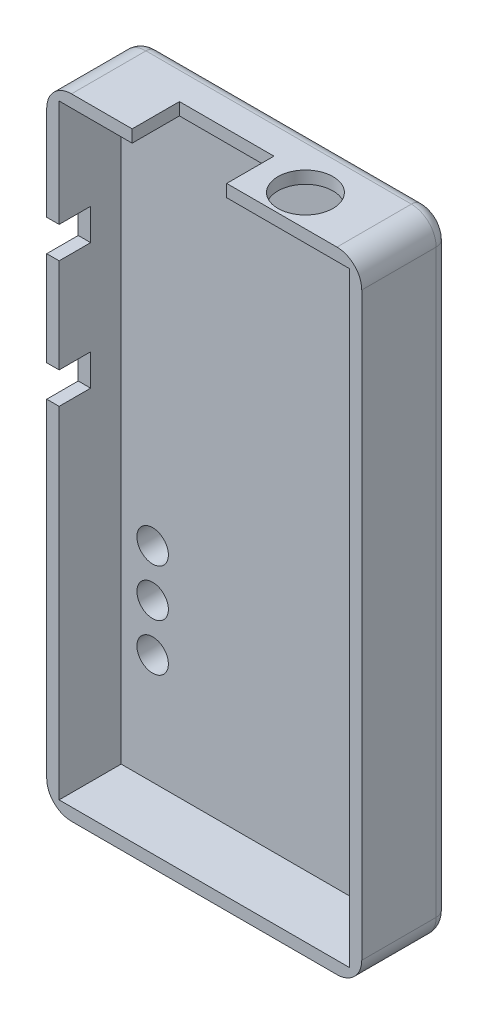
ISO-10303-21;
HEADER;
FILE_DESCRIPTION(('STEP AP214'),'2;1');
FILE_NAME('part.step','',(''),(''),'','','');
FILE_SCHEMA(('AUTOMOTIVE_DESIGN { 1 0 10303 214 1 1 1 1 }'));
ENDSEC;
DATA;
#1=APPLICATION_CONTEXT('core data for automotive mechanical design processes');
#2=APPLICATION_PROTOCOL_DEFINITION('international standard','automotive_design',2000,#1);
#3=PRODUCT_CONTEXT('',#1,'mechanical');
#4=PRODUCT('Part','Part','',(#3));
#5=PRODUCT_RELATED_PRODUCT_CATEGORY('part','',(#4));
#6=PRODUCT_DEFINITION_FORMATION('','',#4);
#7=PRODUCT_DEFINITION_CONTEXT('part definition',#1,'design');
#8=PRODUCT_DEFINITION('design','',#6,#7);
#9=PRODUCT_DEFINITION_SHAPE('','',#8);
#10=(LENGTH_UNIT() NAMED_UNIT(*) SI_UNIT(.MILLI.,.METRE.));
#11=(NAMED_UNIT(*) PLANE_ANGLE_UNIT() SI_UNIT($,.RADIAN.));
#12=(NAMED_UNIT(*) SI_UNIT($,.STERADIAN.) SOLID_ANGLE_UNIT());
#13=UNCERTAINTY_MEASURE_WITH_UNIT(LENGTH_MEASURE(1.E-05),#10,'distance_accuracy_value','');
#14=(GEOMETRIC_REPRESENTATION_CONTEXT(3) GLOBAL_UNCERTAINTY_ASSIGNED_CONTEXT((#13)) GLOBAL_UNIT_ASSIGNED_CONTEXT((#10,
#11,#12)) REPRESENTATION_CONTEXT('',''));
#15=CARTESIAN_POINT('',(0.,0.,0.));
#16=DIRECTION('',(0.,0.,1.));
#17=DIRECTION('',(1.,0.,0.));
#18=AXIS2_PLACEMENT_3D('',#15,#16,#17);
#19=CARTESIAN_POINT('',(0.,0.,7.000000986));
#20=DIRECTION('',(0.,0.,1.));
#21=DIRECTION('',(1.,0.,0.));
#22=AXIS2_PLACEMENT_3D('',#19,#20,#21);
#23=PLANE('',#22);
#24=DIRECTION('',(-1.,0.,0.));
#25=VECTOR('',#24,1.);
#26=CARTESIAN_POINT('',(25.401,31.019999936,7.000000986));
#27=LINE('',#26,#25);
#28=CARTESIAN_POINT('',(1.00000054,31.019999936,7.000000986));
#29=VERTEX_POINT('',#28);
#30=CARTESIAN_POINT('',(0.,31.019999936,7.000000986));
#31=VERTEX_POINT('',#30);
#32=EDGE_CURVE('E225',#29,#31,#27,.T.);
#33=ORIENTED_EDGE('',*,*,#32,.F.);
#34=DIRECTION('',(0.,-1.,0.));
#35=VECTOR('',#34,1.);
#36=CARTESIAN_POINT('',(1.00000054,49.79999946,7.000000986));
#37=LINE('',#36,#35);
#38=CARTESIAN_POINT('',(1.00000054,38.639999936,7.000000986));
#39=VERTEX_POINT('',#38);
#40=EDGE_CURVE('E236',#39,#29,#37,.T.);
#41=ORIENTED_EDGE('',*,*,#40,.F.);
#42=DIRECTION('',(-1.,0.,0.));
#43=VECTOR('',#42,1.);
#44=CARTESIAN_POINT('',(25.401,38.639999936,7.000000986));
#45=LINE('',#44,#43);
#46=CARTESIAN_POINT('',(0.,38.639999936,7.000000986));
#47=VERTEX_POINT('',#46);
#48=EDGE_CURVE('E60',#39,#47,#45,.T.);
#49=ORIENTED_EDGE('',*,*,#48,.T.);
#50=DIRECTION('',(0.,-1.,0.));
#51=VECTOR('',#50,1.);
#52=CARTESIAN_POINT('',(0.,50.8,7.000000986));
#53=LINE('',#52,#51);
#54=EDGE_CURVE('E238',#47,#31,#53,.T.);
#55=ORIENTED_EDGE('',*,*,#54,.T.);
#56=EDGE_LOOP('',(#33,#41,#49,#55));
#57=FACE_BOUND('',#56,.T.);
#58=ADVANCED_FACE('F35',(#57),#23,.T.);
#59=DIRECTION('',(-1.,0.,0.));
#60=VECTOR('',#59,1.);
#61=CARTESIAN_POINT('',(25.401,41.179999936,7.000000986));
#62=LINE('',#61,#60);
#63=CARTESIAN_POINT('',(1.00000054,41.179999936,7.000000986));
#64=VERTEX_POINT('',#63);
#65=CARTESIAN_POINT('',(0.,41.179999936,7.000000986));
#66=VERTEX_POINT('',#65);
#67=EDGE_CURVE('E401',#64,#66,#62,.T.);
#68=ORIENTED_EDGE('',*,*,#67,.F.);
#69=CARTESIAN_POINT('',(1.00000054,49.79999946,7.000000986));
#70=VERTEX_POINT('',#69);
#71=EDGE_CURVE('E244',#70,#64,#37,.T.);
#72=ORIENTED_EDGE('',*,*,#71,.F.);
#73=DIRECTION('',(-1.,0.,0.));
#74=VECTOR('',#73,1.);
#75=CARTESIAN_POINT('',(24.39999946,49.79999946,7.000000986));
#76=LINE('',#75,#74);
#77=CARTESIAN_POINT('',(6.88999993600001,49.79999946,7.000000986));
#78=VERTEX_POINT('',#77);
#79=EDGE_CURVE('E473',#78,#70,#76,.T.);
#80=ORIENTED_EDGE('',*,*,#79,.F.);
#81=DIRECTION('',(0.,1.,0.));
#82=VECTOR('',#81,1.);
#83=CARTESIAN_POINT('',(6.889999936,-0.001000000000001,7.000000986));
#84=LINE('',#83,#82);
#85=CARTESIAN_POINT('',(6.889999936,50.8,7.000000986));
#86=VERTEX_POINT('',#85);
#87=EDGE_CURVE('E405',#78,#86,#84,.T.);
#88=ORIENTED_EDGE('',*,*,#87,.T.);
#89=DIRECTION('',(-1.,0.,0.));
#90=VECTOR('',#89,1.);
#91=CARTESIAN_POINT('',(25.4,50.8,7.000000986));
#92=LINE('',#91,#90);
#93=CARTESIAN_POINT('',(2.000000064,50.8,7.000000986));
#94=VERTEX_POINT('',#93);
#95=EDGE_CURVE('E279',#86,#94,#92,.T.);
#96=ORIENTED_EDGE('',*,*,#95,.T.);
#97=CARTESIAN_POINT('',(2.000000064,48.799999936,7.000000986));
#98=DIRECTION('',(0.,0.,1.));
#99=DIRECTION('',(1.,0.,0.));
#100=AXIS2_PLACEMENT_3D('',#97,#98,#99);
#101=CIRCLE('',#100,2.000000064);
#102=CARTESIAN_POINT('',(0.,48.799999936,7.000000986));
#103=VERTEX_POINT('',#102);
#104=EDGE_CURVE('E303',#94,#103,#101,.T.);
#105=ORIENTED_EDGE('',*,*,#104,.T.);
#106=EDGE_CURVE('E284',#103,#66,#53,.T.);
#107=ORIENTED_EDGE('',*,*,#106,.T.);
#108=EDGE_LOOP('',(#68,#72,#80,#88,#96,#105,#107));
#109=FACE_BOUND('',#108,.T.);
#110=ADVANCED_FACE('F399',(#109),#23,.T.);
#111=CARTESIAN_POINT('',(0.,0.,2.00000108));
#112=DIRECTION('',(1.,0.,0.));
#113=DIRECTION('',(0.,1.,0.));
#114=AXIS2_PLACEMENT_3D('',#111,#112,#113);
#115=PLANE('',#114);
#116=DIRECTION('',(0.,-1.,0.));
#117=VECTOR('',#116,1.);
#118=CARTESIAN_POINT('',(0.,31.019999936,4.460000986));
#119=LINE('',#118,#117);
#120=CARTESIAN_POINT('',(0.,31.019999936,4.460000986));
#121=VERTEX_POINT('',#120);
#122=CARTESIAN_POINT('',(0.,28.479999936,4.460000986));
#123=VERTEX_POINT('',#122);
#124=EDGE_CURVE('E520',#121,#123,#119,.T.);
#125=ORIENTED_EDGE('',*,*,#124,.F.);
#126=DIRECTION('',(0.,0.,-1.));
#127=VECTOR('',#126,1.);
#128=CARTESIAN_POINT('',(0.,31.019999936,7.000000986));
#129=LINE('',#128,#127);
#130=EDGE_CURVE('E523',#31,#121,#129,.T.);
#131=ORIENTED_EDGE('',*,*,#130,.F.);
#132=ORIENTED_EDGE('',*,*,#54,.F.);
#133=DIRECTION('',(0.,0.,1.));
#134=VECTOR('',#133,1.);
#135=CARTESIAN_POINT('',(0.,38.639999936,7.000000986));
#136=LINE('',#135,#134);
#137=CARTESIAN_POINT('',(0.,38.639999936,4.460000986));
#138=VERTEX_POINT('',#137);
#139=EDGE_CURVE('E503',#138,#47,#136,.T.);
#140=ORIENTED_EDGE('',*,*,#139,.F.);
#141=DIRECTION('',(0.,-1.,0.));
#142=VECTOR('',#141,1.);
#143=CARTESIAN_POINT('',(0.,41.179999936,4.460000986));
#144=LINE('',#143,#142);
#145=CARTESIAN_POINT('',(0.,41.179999936,4.460000986));
#146=VERTEX_POINT('',#145);
#147=EDGE_CURVE('E509',#146,#138,#144,.T.);
#148=ORIENTED_EDGE('',*,*,#147,.F.);
#149=DIRECTION('',(0.,0.,-1.));
#150=VECTOR('',#149,1.);
#151=CARTESIAN_POINT('',(0.,41.179999936,7.000000986));
#152=LINE('',#151,#150);
#153=EDGE_CURVE('E396',#66,#146,#152,.T.);
#154=ORIENTED_EDGE('',*,*,#153,.F.);
#155=ORIENTED_EDGE('',*,*,#106,.F.);
#156=DIRECTION('',(0.,0.,-1.));
#157=VECTOR('',#156,1.);
#158=CARTESIAN_POINT('',(0.,48.799999936,2.00000108));
#159=LINE('',#158,#157);
#160=CARTESIAN_POINT('',(0.,48.799999936,1.000000032));
#161=VERTEX_POINT('',#160);
#162=EDGE_CURVE('E295',#103,#161,#159,.T.);
#163=ORIENTED_EDGE('',*,*,#162,.T.);
#164=DIRECTION('',(0.,-1.,0.));
#165=VECTOR('',#164,1.);
#166=CARTESIAN_POINT('',(0.,2.000000064,1.000000032));
#167=LINE('',#166,#165);
#168=CARTESIAN_POINT('',(0.,2.000000064,1.000000032));
#169=VERTEX_POINT('',#168);
#170=EDGE_CURVE('E344',#161,#169,#167,.T.);
#171=ORIENTED_EDGE('',*,*,#170,.T.);
#172=DIRECTION('',(0.,0.,-1.));
#173=VECTOR('',#172,1.);
#174=CARTESIAN_POINT('',(0.,2.000000064,2.00000108));
#175=LINE('',#174,#173);
#176=CARTESIAN_POINT('',(0.,2.000000064,7.000000986));
#177=VERTEX_POINT('',#176);
#178=EDGE_CURVE('E298',#169,#177,#175,.F.);
#179=ORIENTED_EDGE('',*,*,#178,.T.);
#180=CARTESIAN_POINT('',(0.,28.479999936,7.000000986));
#181=VERTEX_POINT('',#180);
#182=EDGE_CURVE('E283',#181,#177,#53,.T.);
#183=ORIENTED_EDGE('',*,*,#182,.F.);
#184=DIRECTION('',(0.,0.,1.));
#185=VECTOR('',#184,1.);
#186=CARTESIAN_POINT('',(0.,28.479999936,7.000000986));
#187=LINE('',#186,#185);
#188=EDGE_CURVE('E239',#123,#181,#187,.T.);
#189=ORIENTED_EDGE('',*,*,#188,.F.);
#190=EDGE_LOOP('',(#125,#131,#132,#140,#148,#154,#155,#163,#171,#179,#183,#189));
#191=FACE_BOUND('',#190,.T.);
#192=ADVANCED_FACE('F391',(#191),#115,.F.);
#193=CARTESIAN_POINT('',(0.,0.,2.00000108));
#194=DIRECTION('',(0.,1.,0.));
#195=DIRECTION('',(0.,0.,1.));
#196=AXIS2_PLACEMENT_3D('',#193,#194,#195);
#197=PLANE('',#196);
#198=DIRECTION('',(0.,0.,-1.));
#199=VECTOR('',#198,1.);
#200=CARTESIAN_POINT('',(2.000000064,0.,2.00000108));
#201=LINE('',#200,#199);
#202=CARTESIAN_POINT('',(2.000000064,0.,7.000000986));
#203=VERTEX_POINT('',#202);
#204=CARTESIAN_POINT('',(2.000000064,0.,1.000000032));
#205=VERTEX_POINT('',#204);
#206=EDGE_CURVE('E292',#203,#205,#201,.T.);
#207=ORIENTED_EDGE('',*,*,#206,.T.);
#208=DIRECTION('',(1.,0.,0.));
#209=VECTOR('',#208,1.);
#210=CARTESIAN_POINT('',(23.399999936,0.,1.000000032));
#211=LINE('',#210,#209);
#212=CARTESIAN_POINT('',(23.399999936,0.,1.000000032));
#213=VERTEX_POINT('',#212);
#214=EDGE_CURVE('E340',#205,#213,#211,.T.);
#215=ORIENTED_EDGE('',*,*,#214,.T.);
#216=DIRECTION('',(0.,0.,-1.));
#217=VECTOR('',#216,1.);
#218=CARTESIAN_POINT('',(23.399999936,0.,2.00000108));
#219=LINE('',#218,#217);
#220=CARTESIAN_POINT('',(23.399999936,0.,7.000000986));
#221=VERTEX_POINT('',#220);
#222=EDGE_CURVE('E290',#213,#221,#219,.F.);
#223=ORIENTED_EDGE('',*,*,#222,.T.);
#224=DIRECTION('',(1.,0.,0.));
#225=VECTOR('',#224,1.);
#226=CARTESIAN_POINT('',(0.,0.,7.000000986));
#227=LINE('',#226,#225);
#228=EDGE_CURVE('E287',#203,#221,#227,.T.);
#229=ORIENTED_EDGE('',*,*,#228,.F.);
#230=EDGE_LOOP('',(#207,#215,#223,#229));
#231=FACE_BOUND('',#230,.T.);
#232=ADVANCED_FACE('F443',(#231),#197,.F.);
#233=CARTESIAN_POINT('',(25.4,0.,2.00000108));
#234=DIRECTION('',(-1.,0.,0.));
#235=DIRECTION('',(0.,-1.,0.));
#236=AXIS2_PLACEMENT_3D('',#233,#234,#235);
#237=PLANE('',#236);
#238=DIRECTION('',(0.,0.,-1.));
#239=VECTOR('',#238,1.);
#240=CARTESIAN_POINT('',(25.4,2.000000064,2.00000108));
#241=LINE('',#240,#239);
#242=CARTESIAN_POINT('',(25.4,2.000000064,7.000000986));
#243=VERTEX_POINT('',#242);
#244=CARTESIAN_POINT('',(25.4,2.000000064,1.000000032));
#245=VERTEX_POINT('',#244);
#246=EDGE_CURVE('E311',#243,#245,#241,.T.);
#247=ORIENTED_EDGE('',*,*,#246,.T.);
#248=DIRECTION('',(0.,1.,0.));
#249=VECTOR('',#248,1.);
#250=CARTESIAN_POINT('',(25.4,48.799999936,1.000000032));
#251=LINE('',#250,#249);
#252=CARTESIAN_POINT('',(25.4,48.799999936,1.000000032));
#253=VERTEX_POINT('',#252);
#254=EDGE_CURVE('E11',#245,#253,#251,.T.);
#255=ORIENTED_EDGE('',*,*,#254,.T.);
#256=DIRECTION('',(0.,0.,-1.));
#257=VECTOR('',#256,1.);
#258=CARTESIAN_POINT('',(25.4,48.799999936,2.00000108));
#259=LINE('',#258,#257);
#260=CARTESIAN_POINT('',(25.4,48.799999936,7.000000986));
#261=VERTEX_POINT('',#260);
#262=EDGE_CURVE('E309',#253,#261,#259,.F.);
#263=ORIENTED_EDGE('',*,*,#262,.T.);
#264=DIRECTION('',(0.,1.,0.));
#265=VECTOR('',#264,1.);
#266=CARTESIAN_POINT('',(25.4,0.,7.000000986));
#267=LINE('',#266,#265);
#268=EDGE_CURVE('E276',#243,#261,#267,.T.);
#269=ORIENTED_EDGE('',*,*,#268,.F.);
#270=EDGE_LOOP('',(#247,#255,#263,#269));
#271=FACE_BOUND('',#270,.T.);
#272=ADVANCED_FACE('F454',(#271),#237,.F.);
#273=CARTESIAN_POINT('',(0.,50.8,2.00000108));
#274=DIRECTION('',(0.,-1.,0.));
#275=DIRECTION('',(0.,0.,-1.));
#276=AXIS2_PLACEMENT_3D('',#273,#274,#275);
#277=PLANE('',#276);
#278=CARTESIAN_POINT('',(18.319999936,50.8,4.460000986));
#279=DIRECTION('',(0.,1.,0.));
#280=DIRECTION('',(0.,0.,1.));
#281=AXIS2_PLACEMENT_3D('',#278,#279,#280);
#282=CIRCLE('',#281,2.2225);
#283=CARTESIAN_POINT('',(18.319999936,50.8,6.682500986));
#284=VERTEX_POINT('',#283);
#285=EDGE_CURVE('E354',#284,#284,#282,.T.);
#286=ORIENTED_EDGE('',*,*,#285,.F.);
#287=EDGE_LOOP('',(#286));
#288=FACE_BOUND('',#287,.T.);
#289=ORIENTED_EDGE('',*,*,#95,.F.);
#290=DIRECTION('',(0.,0.,1.));
#291=VECTOR('',#290,1.);
#292=CARTESIAN_POINT('',(6.889999936,50.8,7.000000986));
#293=LINE('',#292,#291);
#294=CARTESIAN_POINT('',(6.889999936,50.8,3.190000986));
#295=VERTEX_POINT('',#294);
#296=EDGE_CURVE('E462',#295,#86,#293,.T.);
#297=ORIENTED_EDGE('',*,*,#296,.F.);
#298=DIRECTION('',(-1.,0.,0.));
#299=VECTOR('',#298,1.);
#300=CARTESIAN_POINT('',(6.889999936,50.8,3.190000986));
#301=LINE('',#300,#299);
#302=CARTESIAN_POINT('',(14.509999936,50.8,3.190000986));
#303=VERTEX_POINT('',#302);
#304=EDGE_CURVE('E483',#303,#295,#301,.T.);
#305=ORIENTED_EDGE('',*,*,#304,.F.);
#306=DIRECTION('',(0.,0.,-1.));
#307=VECTOR('',#306,1.);
#308=CARTESIAN_POINT('',(14.509999936,50.8,7.000000986));
#309=LINE('',#308,#307);
#310=CARTESIAN_POINT('',(14.509999936,50.8,7.000000986));
#311=VERTEX_POINT('',#310);
#312=EDGE_CURVE('E495',#311,#303,#309,.T.);
#313=ORIENTED_EDGE('',*,*,#312,.F.);
#314=CARTESIAN_POINT('',(23.399999936,50.8,7.000000986));
#315=VERTEX_POINT('',#314);
#316=EDGE_CURVE('E280',#315,#311,#92,.T.);
#317=ORIENTED_EDGE('',*,*,#316,.F.);
#318=DIRECTION('',(0.,0.,-1.));
#319=VECTOR('',#318,1.);
#320=CARTESIAN_POINT('',(23.399999936,50.8,2.00000108));
#321=LINE('',#320,#319);
#322=CARTESIAN_POINT('',(23.399999936,50.8,1.000000032));
#323=VERTEX_POINT('',#322);
#324=EDGE_CURVE('E314',#315,#323,#321,.T.);
#325=ORIENTED_EDGE('',*,*,#324,.T.);
#326=DIRECTION('',(-1.,0.,0.));
#327=VECTOR('',#326,1.);
#328=CARTESIAN_POINT('',(2.000000064,50.8,1.000000032));
#329=LINE('',#328,#327);
#330=CARTESIAN_POINT('',(2.000000064,50.8,1.000000032));
#331=VERTEX_POINT('',#330);
#332=EDGE_CURVE('E348',#323,#331,#329,.T.);
#333=ORIENTED_EDGE('',*,*,#332,.T.);
#334=DIRECTION('',(0.,0.,-1.));
#335=VECTOR('',#334,1.);
#336=CARTESIAN_POINT('',(2.000000064,50.8,2.00000108));
#337=LINE('',#336,#335);
#338=EDGE_CURVE('E317',#331,#94,#337,.F.);
#339=ORIENTED_EDGE('',*,*,#338,.T.);
#340=EDGE_LOOP('',(#289,#297,#305,#313,#317,#325,#333,#339));
#341=FACE_BOUND('',#340,.T.);
#342=ADVANCED_FACE('F408',(#288,#341),#277,.F.);
#343=CARTESIAN_POINT('',(0.,0.,0.));
#344=DIRECTION('',(0.,0.,-1.));
#345=DIRECTION('',(-1.,0.,0.));
#346=AXIS2_PLACEMENT_3D('',#343,#344,#345);
#347=PLANE('',#346);
#348=CARTESIAN_POINT('',(3.540000032,17.510000032,0.));
#349=DIRECTION('',(0.,0.,-1.));
#350=DIRECTION('',(-1.,0.,0.));
#351=AXIS2_PLACEMENT_3D('',#348,#349,#350);
#352=CIRCLE('',#351,1.27);
#353=CARTESIAN_POINT('',(2.270000032,17.510000032,0.));
#354=VERTEX_POINT('',#353);
#355=EDGE_CURVE('E544',#354,#354,#352,.T.);
#356=ORIENTED_EDGE('',*,*,#355,.F.);
#357=EDGE_LOOP('',(#356));
#358=FACE_BOUND('',#357,.T.);
#359=CARTESIAN_POINT('',(3.540000032,13.700000032,0.));
#360=DIRECTION('',(0.,0.,-1.));
#361=DIRECTION('',(-1.,0.,0.));
#362=AXIS2_PLACEMENT_3D('',#359,#360,#361);
#363=CIRCLE('',#362,1.27);
#364=CARTESIAN_POINT('',(2.270000032,13.700000032,0.));
#365=VERTEX_POINT('',#364);
#366=EDGE_CURVE('E538',#365,#365,#363,.T.);
#367=ORIENTED_EDGE('',*,*,#366,.F.);
#368=EDGE_LOOP('',(#367));
#369=FACE_BOUND('',#368,.T.);
#370=CARTESIAN_POINT('',(3.540000032,9.890000032,0.));
#371=DIRECTION('',(0.,0.,-1.));
#372=DIRECTION('',(-1.,0.,0.));
#373=AXIS2_PLACEMENT_3D('',#370,#371,#372);
#374=CIRCLE('',#373,1.27);
#375=CARTESIAN_POINT('',(2.270000032,9.890000032,0.));
#376=VERTEX_POINT('',#375);
#377=EDGE_CURVE('E532',#376,#376,#374,.T.);
#378=ORIENTED_EDGE('',*,*,#377,.F.);
#379=EDGE_LOOP('',(#378));
#380=FACE_BOUND('',#379,.T.);
#381=DIRECTION('',(0.,1.,0.));
#382=VECTOR('',#381,1.);
#383=CARTESIAN_POINT('',(24.399999968,2.000000064,0.));
#384=LINE('',#383,#382);
#385=CARTESIAN_POINT('',(24.399999968,48.799999936,0.));
#386=VERTEX_POINT('',#385);
#387=CARTESIAN_POINT('',(24.399999968,2.000000064,0.));
#388=VERTEX_POINT('',#387);
#389=EDGE_CURVE('E320',#386,#388,#384,.F.);
#390=ORIENTED_EDGE('',*,*,#389,.T.);
#391=CARTESIAN_POINT('',(23.399999936,2.000000064,0.));
#392=DIRECTION('',(0.,0.,-1.));
#393=DIRECTION('',(-1.,0.,0.));
#394=AXIS2_PLACEMENT_3D('',#391,#392,#393);
#395=CIRCLE('',#394,1.000000032);
#396=CARTESIAN_POINT('',(23.399999936,1.000000032,0.));
#397=VERTEX_POINT('',#396);
#398=EDGE_CURVE('E334',#388,#397,#395,.T.);
#399=ORIENTED_EDGE('',*,*,#398,.T.);
#400=DIRECTION('',(1.,0.,0.));
#401=VECTOR('',#400,1.);
#402=CARTESIAN_POINT('',(2.000000064,1.000000032,0.));
#403=LINE('',#402,#401);
#404=CARTESIAN_POINT('',(2.000000064,1.000000032,0.));
#405=VERTEX_POINT('',#404);
#406=EDGE_CURVE('E332',#397,#405,#403,.F.);
#407=ORIENTED_EDGE('',*,*,#406,.T.);
#408=CARTESIAN_POINT('',(2.000000064,2.000000064,0.));
#409=DIRECTION('',(0.,0.,-1.));
#410=DIRECTION('',(-1.,0.,0.));
#411=AXIS2_PLACEMENT_3D('',#408,#409,#410);
#412=CIRCLE('',#411,1.000000032);
#413=CARTESIAN_POINT('',(1.000000032,2.000000064,0.));
#414=VERTEX_POINT('',#413);
#415=EDGE_CURVE('E330',#405,#414,#412,.T.);
#416=ORIENTED_EDGE('',*,*,#415,.T.);
#417=DIRECTION('',(0.,-1.,0.));
#418=VECTOR('',#417,1.);
#419=CARTESIAN_POINT('',(1.000000032,48.799999936,0.));
#420=LINE('',#419,#418);
#421=CARTESIAN_POINT('',(1.000000032,48.799999936,0.));
#422=VERTEX_POINT('',#421);
#423=EDGE_CURVE('E328',#414,#422,#420,.F.);
#424=ORIENTED_EDGE('',*,*,#423,.T.);
#425=CARTESIAN_POINT('',(2.000000064,48.799999936,0.));
#426=DIRECTION('',(0.,0.,-1.));
#427=DIRECTION('',(-1.,0.,0.));
#428=AXIS2_PLACEMENT_3D('',#425,#426,#427);
#429=CIRCLE('',#428,1.000000032);
#430=CARTESIAN_POINT('',(2.000000064,49.799999968,0.));
#431=VERTEX_POINT('',#430);
#432=EDGE_CURVE('E326',#422,#431,#429,.T.);
#433=ORIENTED_EDGE('',*,*,#432,.T.);
#434=DIRECTION('',(-1.,0.,0.));
#435=VECTOR('',#434,1.);
#436=CARTESIAN_POINT('',(23.399999936,49.799999968,0.));
#437=LINE('',#436,#435);
#438=CARTESIAN_POINT('',(23.399999936,49.799999968,0.));
#439=VERTEX_POINT('',#438);
#440=EDGE_CURVE('E324',#431,#439,#437,.F.);
#441=ORIENTED_EDGE('',*,*,#440,.T.);
#442=CARTESIAN_POINT('',(23.399999936,48.799999936,0.));
#443=DIRECTION('',(0.,0.,-1.));
#444=DIRECTION('',(-1.,0.,0.));
#445=AXIS2_PLACEMENT_3D('',#442,#443,#444);
#446=CIRCLE('',#445,1.000000032);
#447=EDGE_CURVE('E322',#439,#386,#446,.T.);
#448=ORIENTED_EDGE('',*,*,#447,.T.);
#449=EDGE_LOOP('',(#390,#399,#407,#416,#424,#433,#441,#448));
#450=FACE_BOUND('',#449,.T.);
#451=ADVANCED_FACE('F428',(#358,#369,#380,#450),#347,.T.);
#452=DIRECTION('',(-1.,0.,0.));
#453=VECTOR('',#452,1.);
#454=CARTESIAN_POINT('',(25.401,28.479999936,7.000000986));
#455=LINE('',#454,#453);
#456=CARTESIAN_POINT('',(1.00000054,28.479999936,7.000000986));
#457=VERTEX_POINT('',#456);
#458=EDGE_CURVE('E52',#457,#181,#455,.T.);
#459=ORIENTED_EDGE('',*,*,#458,.T.);
#460=ORIENTED_EDGE('',*,*,#182,.T.);
#461=CARTESIAN_POINT('',(2.000000064,2.000000064,7.000000986));
#462=DIRECTION('',(0.,0.,1.));
#463=DIRECTION('',(1.,0.,0.));
#464=AXIS2_PLACEMENT_3D('',#461,#462,#463);
#465=CIRCLE('',#464,2.000000064);
#466=EDGE_CURVE('E307',#177,#203,#465,.T.);
#467=ORIENTED_EDGE('',*,*,#466,.T.);
#468=ORIENTED_EDGE('',*,*,#228,.T.);
#469=CARTESIAN_POINT('',(23.399999936,2.000000064,7.000000986));
#470=DIRECTION('',(0.,0.,1.));
#471=DIRECTION('',(1.,0.,0.));
#472=AXIS2_PLACEMENT_3D('',#469,#470,#471);
#473=CIRCLE('',#472,2.000000064);
#474=EDGE_CURVE('E305',#221,#243,#473,.T.);
#475=ORIENTED_EDGE('',*,*,#474,.T.);
#476=ORIENTED_EDGE('',*,*,#268,.T.);
#477=CARTESIAN_POINT('',(23.399999936,48.799999936,7.000000986));
#478=DIRECTION('',(0.,0.,1.));
#479=DIRECTION('',(1.,0.,0.));
#480=AXIS2_PLACEMENT_3D('',#477,#478,#479);
#481=CIRCLE('',#480,2.000000064);
#482=EDGE_CURVE('E301',#261,#315,#481,.T.);
#483=ORIENTED_EDGE('',*,*,#482,.T.);
#484=ORIENTED_EDGE('',*,*,#316,.T.);
#485=DIRECTION('',(0.,1.,0.));
#486=VECTOR('',#485,1.);
#487=CARTESIAN_POINT('',(14.509999936,-0.001000000000001,7.000000986));
#488=LINE('',#487,#486);
#489=CARTESIAN_POINT('',(14.509999936,49.79999946,7.000000986));
#490=VERTEX_POINT('',#489);
#491=EDGE_CURVE('E457',#490,#311,#488,.T.);
#492=ORIENTED_EDGE('',*,*,#491,.F.);
#493=CARTESIAN_POINT('',(24.39999946,49.79999946,7.000000986));
#494=VERTEX_POINT('',#493);
#495=EDGE_CURVE('E249',#494,#490,#76,.T.);
#496=ORIENTED_EDGE('',*,*,#495,.F.);
#497=DIRECTION('',(0.,1.,0.));
#498=VECTOR('',#497,1.);
#499=CARTESIAN_POINT('',(24.39999946,49.79999946,7.000000986));
#500=LINE('',#499,#498);
#501=CARTESIAN_POINT('',(24.39999946,1.00000054,7.000000986));
#502=VERTEX_POINT('',#501);
#503=EDGE_CURVE('E267',#502,#494,#500,.T.);
#504=ORIENTED_EDGE('',*,*,#503,.F.);
#505=DIRECTION('',(1.,0.,0.));
#506=VECTOR('',#505,1.);
#507=CARTESIAN_POINT('',(24.39999946,1.00000054,7.000000986));
#508=LINE('',#507,#506);
#509=CARTESIAN_POINT('',(1.00000054000001,1.00000054,7.000000986));
#510=VERTEX_POINT('',#509);
#511=EDGE_CURVE('E248',#510,#502,#508,.T.);
#512=ORIENTED_EDGE('',*,*,#511,.F.);
#513=EDGE_CURVE('E245',#457,#510,#37,.T.);
#514=ORIENTED_EDGE('',*,*,#513,.F.);
#515=EDGE_LOOP('',(#459,#460,#467,#468,#475,#476,#483,#484,#492,#496,#504,#512,#514));
#516=FACE_BOUND('',#515,.T.);
#517=ADVANCED_FACE('F447',(#516),#23,.T.);
#518=CARTESIAN_POINT('',(24.39999946,49.79999946,7.000000986));
#519=DIRECTION('',(-1.,0.,0.));
#520=DIRECTION('',(0.,-1.,0.));
#521=AXIS2_PLACEMENT_3D('',#518,#519,#520);
#522=PLANE('',#521);
#523=DIRECTION('',(0.,1.,0.));
#524=VECTOR('',#523,1.);
#525=CARTESIAN_POINT('',(24.39999946,49.79999946,2.00000108));
#526=LINE('',#525,#524);
#527=CARTESIAN_POINT('',(24.39999946,1.00000054,2.00000108));
#528=VERTEX_POINT('',#527);
#529=CARTESIAN_POINT('',(24.39999946,49.79999946,2.00000108));
#530=VERTEX_POINT('',#529);
#531=EDGE_CURVE('E255',#528,#530,#526,.T.);
#532=ORIENTED_EDGE('',*,*,#531,.F.);
#533=DIRECTION('',(0.,0.,-1.));
#534=VECTOR('',#533,1.);
#535=CARTESIAN_POINT('',(24.39999946,1.00000054,7.000000986));
#536=LINE('',#535,#534);
#537=EDGE_CURVE('E254',#502,#528,#536,.T.);
#538=ORIENTED_EDGE('',*,*,#537,.F.);
#539=ORIENTED_EDGE('',*,*,#503,.T.);
#540=DIRECTION('',(0.,0.,-1.));
#541=VECTOR('',#540,1.);
#542=CARTESIAN_POINT('',(24.39999946,49.79999946,7.000000986));
#543=LINE('',#542,#541);
#544=EDGE_CURVE('E273',#494,#530,#543,.T.);
#545=ORIENTED_EDGE('',*,*,#544,.T.);
#546=EDGE_LOOP('',(#532,#538,#539,#545));
#547=FACE_BOUND('',#546,.T.);
#548=ADVANCED_FACE('F578',(#547),#522,.T.);
#549=CARTESIAN_POINT('',(24.39999946,49.79999946,7.000000986));
#550=DIRECTION('',(0.,-1.,0.));
#551=DIRECTION('',(0.,0.,-1.));
#552=AXIS2_PLACEMENT_3D('',#549,#550,#551);
#553=PLANE('',#552);
#554=DIRECTION('',(0.,0.,1.));
#555=VECTOR('',#554,1.);
#556=CARTESIAN_POINT('',(6.889999936,49.79999946,7.000000986));
#557=LINE('',#556,#555);
#558=CARTESIAN_POINT('',(6.889999936,49.79999946,3.190000986));
#559=VERTEX_POINT('',#558);
#560=EDGE_CURVE('E485',#559,#78,#557,.T.);
#561=ORIENTED_EDGE('',*,*,#560,.T.);
#562=ORIENTED_EDGE('',*,*,#79,.T.);
#563=DIRECTION('',(0.,0.,-1.));
#564=VECTOR('',#563,1.);
#565=CARTESIAN_POINT('',(1.00000054,49.79999946,7.000000986));
#566=LINE('',#565,#564);
#567=CARTESIAN_POINT('',(1.00000054,49.79999946,2.00000108));
#568=VERTEX_POINT('',#567);
#569=EDGE_CURVE('E271',#70,#568,#566,.T.);
#570=ORIENTED_EDGE('',*,*,#569,.T.);
#571=DIRECTION('',(-1.,0.,0.));
#572=VECTOR('',#571,1.);
#573=CARTESIAN_POINT('',(24.39999946,49.79999946,2.00000108));
#574=LINE('',#573,#572);
#575=EDGE_CURVE('E258',#530,#568,#574,.T.);
#576=ORIENTED_EDGE('',*,*,#575,.F.);
#577=ORIENTED_EDGE('',*,*,#544,.F.);
#578=ORIENTED_EDGE('',*,*,#495,.T.);
#579=DIRECTION('',(0.,0.,-1.));
#580=VECTOR('',#579,1.);
#581=CARTESIAN_POINT('',(14.509999936,49.79999946,7.000000986));
#582=LINE('',#581,#580);
#583=CARTESIAN_POINT('',(14.509999936,49.79999946,3.190000986));
#584=VERTEX_POINT('',#583);
#585=EDGE_CURVE('E472',#490,#584,#582,.T.);
#586=ORIENTED_EDGE('',*,*,#585,.T.);
#587=DIRECTION('',(-1.,0.,0.));
#588=VECTOR('',#587,1.);
#589=CARTESIAN_POINT('',(6.889999936,49.79999946,3.190000986));
#590=LINE('',#589,#588);
#591=EDGE_CURVE('E484',#584,#559,#590,.T.);
#592=ORIENTED_EDGE('',*,*,#591,.T.);
#593=EDGE_LOOP('',(#561,#562,#570,#576,#577,#578,#586,#592));
#594=FACE_BOUND('',#593,.T.);
#595=CARTESIAN_POINT('',(18.319999936,49.79999946,4.460000986));
#596=DIRECTION('',(0.,-1.,0.));
#597=DIRECTION('',(0.,0.,-1.));
#598=AXIS2_PLACEMENT_3D('',#595,#596,#597);
#599=CIRCLE('',#598,2.2225);
#600=CARTESIAN_POINT('',(18.319999936,49.79999946,2.237500986));
#601=VERTEX_POINT('',#600);
#602=EDGE_CURVE('E480',#601,#601,#599,.F.);
#603=ORIENTED_EDGE('',*,*,#602,.T.);
#604=EDGE_LOOP('',(#603));
#605=FACE_BOUND('',#604,.T.);
#606=ADVANCED_FACE('F469',(#594,#605),#553,.T.);
#607=CARTESIAN_POINT('',(1.00000054,49.79999946,7.000000986));
#608=DIRECTION('',(1.,0.,0.));
#609=DIRECTION('',(0.,1.,0.));
#610=AXIS2_PLACEMENT_3D('',#607,#608,#609);
#611=PLANE('',#610);
#612=DIRECTION('',(0.,0.,-1.));
#613=VECTOR('',#612,1.);
#614=CARTESIAN_POINT('',(1.00000054,31.019999936,7.000000986));
#615=LINE('',#614,#613);
#616=CARTESIAN_POINT('',(1.00000054,31.019999936,4.460000986));
#617=VERTEX_POINT('',#616);
#618=EDGE_CURVE('E221',#29,#617,#615,.T.);
#619=ORIENTED_EDGE('',*,*,#618,.T.);
#620=DIRECTION('',(0.,-1.,0.));
#621=VECTOR('',#620,1.);
#622=CARTESIAN_POINT('',(1.00000054,31.019999936,4.460000986));
#623=LINE('',#622,#621);
#624=CARTESIAN_POINT('',(1.00000054,28.479999936,4.460000986));
#625=VERTEX_POINT('',#624);
#626=EDGE_CURVE('E527',#617,#625,#623,.T.);
#627=ORIENTED_EDGE('',*,*,#626,.T.);
#628=DIRECTION('',(0.,0.,1.));
#629=VECTOR('',#628,1.);
#630=CARTESIAN_POINT('',(1.00000054,28.479999936,7.000000986));
#631=LINE('',#630,#629);
#632=EDGE_CURVE('E525',#625,#457,#631,.T.);
#633=ORIENTED_EDGE('',*,*,#632,.T.);
#634=ORIENTED_EDGE('',*,*,#513,.T.);
#635=DIRECTION('',(0.,0.,-1.));
#636=VECTOR('',#635,1.);
#637=CARTESIAN_POINT('',(1.00000054000001,1.00000054,7.000000986));
#638=LINE('',#637,#636);
#639=CARTESIAN_POINT('',(1.00000054000001,1.00000054,2.00000108));
#640=VERTEX_POINT('',#639);
#641=EDGE_CURVE('E269',#510,#640,#638,.T.);
#642=ORIENTED_EDGE('',*,*,#641,.T.);
#643=DIRECTION('',(0.,-1.,0.));
#644=VECTOR('',#643,1.);
#645=CARTESIAN_POINT('',(1.00000054,49.79999946,2.00000108));
#646=LINE('',#645,#644);
#647=EDGE_CURVE('E261',#568,#640,#646,.T.);
#648=ORIENTED_EDGE('',*,*,#647,.F.);
#649=ORIENTED_EDGE('',*,*,#569,.F.);
#650=ORIENTED_EDGE('',*,*,#71,.T.);
#651=DIRECTION('',(0.,0.,-1.));
#652=VECTOR('',#651,1.);
#653=CARTESIAN_POINT('',(1.00000054,41.179999936,7.000000986));
#654=LINE('',#653,#652);
#655=CARTESIAN_POINT('',(1.00000054,41.179999936,4.460000986));
#656=VERTEX_POINT('',#655);
#657=EDGE_CURVE('E493',#64,#656,#654,.T.);
#658=ORIENTED_EDGE('',*,*,#657,.T.);
#659=DIRECTION('',(0.,-1.,0.));
#660=VECTOR('',#659,1.);
#661=CARTESIAN_POINT('',(1.00000054,41.179999936,4.460000986));
#662=LINE('',#661,#660);
#663=CARTESIAN_POINT('',(1.00000054,38.639999936,4.460000986));
#664=VERTEX_POINT('',#663);
#665=EDGE_CURVE('E231',#656,#664,#662,.T.);
#666=ORIENTED_EDGE('',*,*,#665,.T.);
#667=DIRECTION('',(0.,0.,1.));
#668=VECTOR('',#667,1.);
#669=CARTESIAN_POINT('',(1.00000054,38.639999936,7.000000986));
#670=LINE('',#669,#668);
#671=EDGE_CURVE('E243',#664,#39,#670,.T.);
#672=ORIENTED_EDGE('',*,*,#671,.T.);
#673=ORIENTED_EDGE('',*,*,#40,.T.);
#674=EDGE_LOOP('',(#619,#627,#633,#634,#642,#648,#649,#650,#658,#666,#672,#673));
#675=FACE_BOUND('',#674,.T.);
#676=ADVANCED_FACE('F241',(#675),#611,.T.);
#677=CARTESIAN_POINT('',(24.39999946,1.00000054,7.000000986));
#678=DIRECTION('',(0.,1.,0.));
#679=DIRECTION('',(-1.,0.,0.));
#680=AXIS2_PLACEMENT_3D('',#677,#678,#679);
#681=PLANE('',#680);
#682=DIRECTION('',(1.,0.,0.));
#683=VECTOR('',#682,1.);
#684=CARTESIAN_POINT('',(24.39999946,1.00000054,2.00000108));
#685=LINE('',#684,#683);
#686=EDGE_CURVE('E264',#640,#528,#685,.T.);
#687=ORIENTED_EDGE('',*,*,#686,.F.);
#688=ORIENTED_EDGE('',*,*,#641,.F.);
#689=ORIENTED_EDGE('',*,*,#511,.T.);
#690=ORIENTED_EDGE('',*,*,#537,.T.);
#691=EDGE_LOOP('',(#687,#688,#689,#690));
#692=FACE_BOUND('',#691,.T.);
#693=ADVANCED_FACE('F569',(#692),#681,.T.);
#694=CARTESIAN_POINT('',(0.,0.,2.00000108));
#695=DIRECTION('',(0.,0.,-1.));
#696=DIRECTION('',(-1.,0.,0.));
#697=AXIS2_PLACEMENT_3D('',#694,#695,#696);
#698=PLANE('',#697);
#699=CARTESIAN_POINT('',(3.540000032,17.510000032,2.00000108));
#700=DIRECTION('',(0.,0.,-1.));
#701=DIRECTION('',(-1.,0.,0.));
#702=AXIS2_PLACEMENT_3D('',#699,#700,#701);
#703=CIRCLE('',#702,1.27);
#704=CARTESIAN_POINT('',(2.270000032,17.510000032,2.00000108));
#705=VERTEX_POINT('',#704);
#706=EDGE_CURVE('E541',#705,#705,#703,.F.);
#707=ORIENTED_EDGE('',*,*,#706,.F.);
#708=EDGE_LOOP('',(#707));
#709=FACE_BOUND('',#708,.T.);
#710=CARTESIAN_POINT('',(3.540000032,13.700000032,2.00000108));
#711=DIRECTION('',(0.,0.,-1.));
#712=DIRECTION('',(-1.,0.,0.));
#713=AXIS2_PLACEMENT_3D('',#710,#711,#712);
#714=CIRCLE('',#713,1.27);
#715=CARTESIAN_POINT('',(2.270000032,13.700000032,2.00000108));
#716=VERTEX_POINT('',#715);
#717=EDGE_CURVE('E535',#716,#716,#714,.F.);
#718=ORIENTED_EDGE('',*,*,#717,.F.);
#719=EDGE_LOOP('',(#718));
#720=FACE_BOUND('',#719,.T.);
#721=CARTESIAN_POINT('',(3.540000032,9.890000032,2.00000108));
#722=DIRECTION('',(0.,0.,-1.));
#723=DIRECTION('',(-1.,0.,0.));
#724=AXIS2_PLACEMENT_3D('',#721,#722,#723);
#725=CIRCLE('',#724,1.27);
#726=CARTESIAN_POINT('',(2.270000032,9.890000032,2.00000108));
#727=VERTEX_POINT('',#726);
#728=EDGE_CURVE('E529',#727,#727,#725,.F.);
#729=ORIENTED_EDGE('',*,*,#728,.F.);
#730=EDGE_LOOP('',(#729));
#731=FACE_BOUND('',#730,.T.);
#732=ORIENTED_EDGE('',*,*,#686,.T.);
#733=ORIENTED_EDGE('',*,*,#531,.T.);
#734=ORIENTED_EDGE('',*,*,#575,.T.);
#735=ORIENTED_EDGE('',*,*,#647,.T.);
#736=EDGE_LOOP('',(#732,#733,#734,#735));
#737=FACE_BOUND('',#736,.T.);
#738=ADVANCED_FACE('F566',(#709,#720,#731,#737),#698,.F.);
#739=CARTESIAN_POINT('',(2.000000064,2.000000064,2.00000108));
#740=DIRECTION('',(0.,0.,-1.));
#741=DIRECTION('',(-1.,0.,0.));
#742=AXIS2_PLACEMENT_3D('',#739,#740,#741);
#743=CYLINDRICAL_SURFACE('',#742,2.000000064);
#744=ORIENTED_EDGE('',*,*,#178,.F.);
#745=CARTESIAN_POINT('',(2.000000064,2.000000064,1.000000032));
#746=DIRECTION('',(0.,0.,-1.));
#747=DIRECTION('',(-1.,0.,0.));
#748=AXIS2_PLACEMENT_3D('',#745,#746,#747);
#749=CIRCLE('',#748,2.000000064);
#750=EDGE_CURVE('E342',#169,#205,#749,.F.);
#751=ORIENTED_EDGE('',*,*,#750,.T.);
#752=ORIENTED_EDGE('',*,*,#206,.F.);
#753=ORIENTED_EDGE('',*,*,#466,.F.);
#754=EDGE_LOOP('',(#744,#751,#752,#753));
#755=FACE_BOUND('',#754,.T.);
#756=ADVANCED_FACE('F439',(#755),#743,.T.);
#757=CARTESIAN_POINT('',(23.399999936,2.000000064,2.00000108));
#758=DIRECTION('',(0.,0.,-1.));
#759=DIRECTION('',(-1.,0.,0.));
#760=AXIS2_PLACEMENT_3D('',#757,#758,#759);
#761=CYLINDRICAL_SURFACE('',#760,2.000000064);
#762=ORIENTED_EDGE('',*,*,#222,.F.);
#763=CARTESIAN_POINT('',(23.399999936,2.000000064,1.000000032));
#764=DIRECTION('',(0.,0.,-1.));
#765=DIRECTION('',(-1.,0.,0.));
#766=AXIS2_PLACEMENT_3D('',#763,#764,#765);
#767=CIRCLE('',#766,2.000000064);
#768=EDGE_CURVE('E337',#213,#245,#767,.F.);
#769=ORIENTED_EDGE('',*,*,#768,.T.);
#770=ORIENTED_EDGE('',*,*,#246,.F.);
#771=ORIENTED_EDGE('',*,*,#474,.F.);
#772=EDGE_LOOP('',(#762,#769,#770,#771));
#773=FACE_BOUND('',#772,.T.);
#774=ADVANCED_FACE('F451',(#773),#761,.T.);
#775=CARTESIAN_POINT('',(2.000000064,48.799999936,2.00000108));
#776=DIRECTION('',(0.,0.,-1.));
#777=DIRECTION('',(-1.,0.,0.));
#778=AXIS2_PLACEMENT_3D('',#775,#776,#777);
#779=CYLINDRICAL_SURFACE('',#778,2.000000064);
#780=ORIENTED_EDGE('',*,*,#338,.F.);
#781=CARTESIAN_POINT('',(2.000000064,48.799999936,1.000000032));
#782=DIRECTION('',(0.,0.,-1.));
#783=DIRECTION('',(-1.,0.,0.));
#784=AXIS2_PLACEMENT_3D('',#781,#782,#783);
#785=CIRCLE('',#784,2.000000064);
#786=EDGE_CURVE('E346',#331,#161,#785,.F.);
#787=ORIENTED_EDGE('',*,*,#786,.T.);
#788=ORIENTED_EDGE('',*,*,#162,.F.);
#789=ORIENTED_EDGE('',*,*,#104,.F.);
#790=EDGE_LOOP('',(#780,#787,#788,#789));
#791=FACE_BOUND('',#790,.T.);
#792=ADVANCED_FACE('F386',(#791),#779,.T.);
#793=CARTESIAN_POINT('',(23.399999936,48.799999936,2.00000108));
#794=DIRECTION('',(0.,0.,-1.));
#795=DIRECTION('',(-1.,0.,0.));
#796=AXIS2_PLACEMENT_3D('',#793,#794,#795);
#797=CYLINDRICAL_SURFACE('',#796,2.000000064);
#798=ORIENTED_EDGE('',*,*,#262,.F.);
#799=CARTESIAN_POINT('',(23.399999936,48.799999936,1.000000032));
#800=DIRECTION('',(0.,0.,-1.));
#801=DIRECTION('',(-1.,0.,0.));
#802=AXIS2_PLACEMENT_3D('',#799,#800,#801);
#803=CIRCLE('',#802,2.000000064);
#804=EDGE_CURVE('E44',#253,#323,#803,.F.);
#805=ORIENTED_EDGE('',*,*,#804,.T.);
#806=ORIENTED_EDGE('',*,*,#324,.F.);
#807=ORIENTED_EDGE('',*,*,#482,.F.);
#808=EDGE_LOOP('',(#798,#805,#806,#807));
#809=FACE_BOUND('',#808,.T.);
#810=ADVANCED_FACE('F415',(#809),#797,.T.);
#811=CARTESIAN_POINT('',(2.000000064,48.799999936,1.000000032));
#812=DIRECTION('',(0.,0.,-1.));
#813=DIRECTION('',(-1.,0.,0.));
#814=AXIS2_PLACEMENT_3D('',#811,#812,#813);
#815=DEGENERATE_TOROIDAL_SURFACE('',#814,1.000000032,1.000000032,.T.);
#816=CARTESIAN_POINT('',(1.000000032,48.799999936,1.000000032));
#817=DIRECTION('',(0.,-1.,0.));
#818=DIRECTION('',(0.,0.,-1.));
#819=AXIS2_PLACEMENT_3D('',#816,#817,#818);
#820=CIRCLE('',#819,1.000000032);
#821=EDGE_CURVE('E367',#161,#422,#820,.T.);
#822=ORIENTED_EDGE('',*,*,#821,.F.);
#823=ORIENTED_EDGE('',*,*,#786,.F.);
#824=CARTESIAN_POINT('',(2.000000064,49.799999968,1.000000032));
#825=DIRECTION('',(1.,0.,0.));
#826=DIRECTION('',(0.,0.,-1.));
#827=AXIS2_PLACEMENT_3D('',#824,#825,#826);
#828=CIRCLE('',#827,1.000000032);
#829=EDGE_CURVE('E39',#431,#331,#828,.T.);
#830=ORIENTED_EDGE('',*,*,#829,.F.);
#831=ORIENTED_EDGE('',*,*,#432,.F.);
#832=EDGE_LOOP('',(#822,#823,#830,#831));
#833=FACE_BOUND('',#832,.T.);
#834=ADVANCED_FACE('F37',(#833),#815,.T.);
#835=CARTESIAN_POINT('',(0.,49.799999968,1.000000032));
#836=DIRECTION('',(1.,0.,0.));
#837=DIRECTION('',(0.,0.,-1.));
#838=AXIS2_PLACEMENT_3D('',#835,#836,#837);
#839=CYLINDRICAL_SURFACE('',#838,1.000000032);
#840=ORIENTED_EDGE('',*,*,#829,.T.);
#841=ORIENTED_EDGE('',*,*,#332,.F.);
#842=CARTESIAN_POINT('',(23.399999936,49.799999968,1.000000032));
#843=DIRECTION('',(1.,0.,0.));
#844=DIRECTION('',(0.,0.,-1.));
#845=AXIS2_PLACEMENT_3D('',#842,#843,#844);
#846=CIRCLE('',#845,1.000000032);
#847=EDGE_CURVE('E365',#439,#323,#846,.T.);
#848=ORIENTED_EDGE('',*,*,#847,.F.);
#849=ORIENTED_EDGE('',*,*,#440,.F.);
#850=EDGE_LOOP('',(#840,#841,#848,#849));
#851=FACE_BOUND('',#850,.T.);
#852=ADVANCED_FACE('F378',(#851),#839,.T.);
#853=CARTESIAN_POINT('',(1.000000032,0.,1.000000032));
#854=DIRECTION('',(0.,1.,0.));
#855=DIRECTION('',(-1.,0.,0.));
#856=AXIS2_PLACEMENT_3D('',#853,#854,#855);
#857=CYLINDRICAL_SURFACE('',#856,1.000000032);
#858=ORIENTED_EDGE('',*,*,#821,.T.);
#859=ORIENTED_EDGE('',*,*,#423,.F.);
#860=CARTESIAN_POINT('',(1.000000032,2.000000064,1.000000032));
#861=DIRECTION('',(0.,-1.,0.));
#862=DIRECTION('',(0.,0.,-1.));
#863=AXIS2_PLACEMENT_3D('',#860,#861,#862);
#864=CIRCLE('',#863,1.000000032);
#865=EDGE_CURVE('E362',#169,#414,#864,.T.);
#866=ORIENTED_EDGE('',*,*,#865,.F.);
#867=ORIENTED_EDGE('',*,*,#170,.F.);
#868=EDGE_LOOP('',(#858,#859,#866,#867));
#869=FACE_BOUND('',#868,.T.);
#870=ADVANCED_FACE('F431',(#869),#857,.T.);
#871=CARTESIAN_POINT('',(23.399999936,48.799999936,1.000000032));
#872=DIRECTION('',(0.,0.,-1.));
#873=DIRECTION('',(-1.,0.,0.));
#874=AXIS2_PLACEMENT_3D('',#871,#872,#873);
#875=DEGENERATE_TOROIDAL_SURFACE('',#874,1.000000032,1.000000032,.T.);
#876=ORIENTED_EDGE('',*,*,#847,.T.);
#877=ORIENTED_EDGE('',*,*,#804,.F.);
#878=CARTESIAN_POINT('',(24.399999968,48.799999936,1.000000032));
#879=DIRECTION('',(0.,-1.,0.));
#880=DIRECTION('',(0.,0.,-1.));
#881=AXIS2_PLACEMENT_3D('',#878,#879,#880);
#882=CIRCLE('',#881,1.000000032);
#883=EDGE_CURVE('E359',#386,#253,#882,.T.);
#884=ORIENTED_EDGE('',*,*,#883,.F.);
#885=ORIENTED_EDGE('',*,*,#447,.F.);
#886=EDGE_LOOP('',(#876,#877,#884,#885));
#887=FACE_BOUND('',#886,.T.);
#888=ADVANCED_FACE('F419',(#887),#875,.T.);
#889=CARTESIAN_POINT('',(2.000000064,2.000000064,1.000000032));
#890=DIRECTION('',(0.,0.,-1.));
#891=DIRECTION('',(-1.,0.,0.));
#892=AXIS2_PLACEMENT_3D('',#889,#890,#891);
#893=DEGENERATE_TOROIDAL_SURFACE('',#892,1.000000032,1.000000032,.T.);
#894=ORIENTED_EDGE('',*,*,#865,.T.);
#895=ORIENTED_EDGE('',*,*,#415,.F.);
#896=CARTESIAN_POINT('',(2.000000064,1.000000032,1.000000032));
#897=DIRECTION('',(1.,0.,0.));
#898=DIRECTION('',(0.,0.,-1.));
#899=AXIS2_PLACEMENT_3D('',#896,#897,#898);
#900=CIRCLE('',#899,1.000000032);
#901=EDGE_CURVE('E356',#205,#405,#900,.T.);
#902=ORIENTED_EDGE('',*,*,#901,.F.);
#903=ORIENTED_EDGE('',*,*,#750,.F.);
#904=EDGE_LOOP('',(#894,#895,#902,#903));
#905=FACE_BOUND('',#904,.T.);
#906=ADVANCED_FACE('F434',(#905),#893,.T.);
#907=CARTESIAN_POINT('',(24.399999968,0.,1.000000032));
#908=DIRECTION('',(0.,-1.,0.));
#909=DIRECTION('',(1.,0.,0.));
#910=AXIS2_PLACEMENT_3D('',#907,#908,#909);
#911=CYLINDRICAL_SURFACE('',#910,1.000000032);
#912=ORIENTED_EDGE('',*,*,#883,.T.);
#913=ORIENTED_EDGE('',*,*,#254,.F.);
#914=CARTESIAN_POINT('',(24.399999968,2.000000064,1.000000032));
#915=DIRECTION('',(0.,-1.,0.));
#916=DIRECTION('',(0.,0.,-1.));
#917=AXIS2_PLACEMENT_3D('',#914,#915,#916);
#918=CIRCLE('',#917,1.000000032);
#919=EDGE_CURVE('E353',#388,#245,#918,.T.);
#920=ORIENTED_EDGE('',*,*,#919,.F.);
#921=ORIENTED_EDGE('',*,*,#389,.F.);
#922=EDGE_LOOP('',(#912,#913,#920,#921));
#923=FACE_BOUND('',#922,.T.);
#924=ADVANCED_FACE('F424',(#923),#911,.T.);
#925=CARTESIAN_POINT('',(0.,1.000000032,1.000000032));
#926=DIRECTION('',(-1.,0.,0.));
#927=DIRECTION('',(0.,0.,1.));
#928=AXIS2_PLACEMENT_3D('',#925,#926,#927);
#929=CYLINDRICAL_SURFACE('',#928,1.000000032);
#930=ORIENTED_EDGE('',*,*,#901,.T.);
#931=ORIENTED_EDGE('',*,*,#406,.F.);
#932=CARTESIAN_POINT('',(23.399999936,1.000000032,1.000000032));
#933=DIRECTION('',(1.,0.,0.));
#934=DIRECTION('',(0.,0.,-1.));
#935=AXIS2_PLACEMENT_3D('',#932,#933,#934);
#936=CIRCLE('',#935,1.000000032);
#937=EDGE_CURVE('E351',#213,#397,#936,.T.);
#938=ORIENTED_EDGE('',*,*,#937,.F.);
#939=ORIENTED_EDGE('',*,*,#214,.F.);
#940=EDGE_LOOP('',(#930,#931,#938,#939));
#941=FACE_BOUND('',#940,.T.);
#942=ADVANCED_FACE('F613',(#941),#929,.T.);
#943=CARTESIAN_POINT('',(23.399999936,2.000000064,1.000000032));
#944=DIRECTION('',(0.,0.,-1.));
#945=DIRECTION('',(-1.,0.,0.));
#946=AXIS2_PLACEMENT_3D('',#943,#944,#945);
#947=DEGENERATE_TOROIDAL_SURFACE('',#946,1.000000032,1.000000032,.T.);
#948=ORIENTED_EDGE('',*,*,#919,.T.);
#949=ORIENTED_EDGE('',*,*,#768,.F.);
#950=ORIENTED_EDGE('',*,*,#937,.T.);
#951=ORIENTED_EDGE('',*,*,#398,.F.);
#952=EDGE_LOOP('',(#948,#949,#950,#951));
#953=FACE_BOUND('',#952,.T.);
#954=ADVANCED_FACE('F609',(#953),#947,.T.);
#955=CARTESIAN_POINT('',(18.319999936,-0.001000000000001,4.460000986));
#956=DIRECTION('',(0.,1.,0.));
#957=DIRECTION('',(0.,0.,1.));
#958=AXIS2_PLACEMENT_3D('',#955,#956,#957);
#959=CYLINDRICAL_SURFACE('',#958,2.2225);
#960=ORIENTED_EDGE('',*,*,#602,.F.);
#961=EDGE_LOOP('',(#960));
#962=FACE_BOUND('',#961,.T.);
#963=ORIENTED_EDGE('',*,*,#285,.T.);
#964=EDGE_LOOP('',(#963));
#965=FACE_BOUND('',#964,.T.);
#966=ADVANCED_FACE('F612',(#962,#965),#959,.F.);
#967=CARTESIAN_POINT('',(6.889999936,-0.001000000000001,7.000000986));
#968=DIRECTION('',(-1.,0.,0.));
#969=DIRECTION('',(0.,0.,1.));
#970=AXIS2_PLACEMENT_3D('',#967,#968,#969);
#971=PLANE('',#970);
#972=DIRECTION('',(0.,1.,0.));
#973=VECTOR('',#972,1.);
#974=CARTESIAN_POINT('',(6.889999936,-0.001000000000001,3.190000986));
#975=LINE('',#974,#973);
#976=EDGE_CURVE('E488',#559,#295,#975,.T.);
#977=ORIENTED_EDGE('',*,*,#976,.T.);
#978=ORIENTED_EDGE('',*,*,#296,.T.);
#979=ORIENTED_EDGE('',*,*,#87,.F.);
#980=ORIENTED_EDGE('',*,*,#560,.F.);
#981=EDGE_LOOP('',(#977,#978,#979,#980));
#982=FACE_BOUND('',#981,.T.);
#983=ADVANCED_FACE('F683',(#982),#971,.F.);
#984=CARTESIAN_POINT('',(6.889999936,-0.001000000000001,3.190000986));
#985=DIRECTION('',(0.,0.,-1.));
#986=DIRECTION('',(-1.,0.,0.));
#987=AXIS2_PLACEMENT_3D('',#984,#985,#986);
#988=PLANE('',#987);
#989=DIRECTION('',(0.,1.,0.));
#990=VECTOR('',#989,1.);
#991=CARTESIAN_POINT('',(14.509999936,-0.001000000000001,3.190000986));
#992=LINE('',#991,#990);
#993=EDGE_CURVE('E463',#584,#303,#992,.T.);
#994=ORIENTED_EDGE('',*,*,#993,.T.);
#995=ORIENTED_EDGE('',*,*,#304,.T.);
#996=ORIENTED_EDGE('',*,*,#976,.F.);
#997=ORIENTED_EDGE('',*,*,#591,.F.);
#998=EDGE_LOOP('',(#994,#995,#996,#997));
#999=FACE_BOUND('',#998,.T.);
#1000=ADVANCED_FACE('F688',(#999),#988,.F.);
#1001=CARTESIAN_POINT('',(14.509999936,-0.001000000000001,7.000000986));
#1002=DIRECTION('',(1.,0.,0.));
#1003=DIRECTION('',(0.,0.,-1.));
#1004=AXIS2_PLACEMENT_3D('',#1001,#1002,#1003);
#1005=PLANE('',#1004);
#1006=ORIENTED_EDGE('',*,*,#491,.T.);
#1007=ORIENTED_EDGE('',*,*,#312,.T.);
#1008=ORIENTED_EDGE('',*,*,#993,.F.);
#1009=ORIENTED_EDGE('',*,*,#585,.F.);
#1010=EDGE_LOOP('',(#1006,#1007,#1008,#1009));
#1011=FACE_BOUND('',#1010,.T.);
#1012=ADVANCED_FACE('F700',(#1011),#1005,.F.);
#1013=CARTESIAN_POINT('',(25.401,41.179999936,7.000000986));
#1014=DIRECTION('',(0.,1.,0.));
#1015=DIRECTION('',(-1.,0.,0.));
#1016=AXIS2_PLACEMENT_3D('',#1013,#1014,#1015);
#1017=PLANE('',#1016);
#1018=ORIENTED_EDGE('',*,*,#67,.T.);
#1019=ORIENTED_EDGE('',*,*,#153,.T.);
#1020=DIRECTION('',(-1.,0.,0.));
#1021=VECTOR('',#1020,1.);
#1022=CARTESIAN_POINT('',(25.401,41.179999936,4.460000986));
#1023=LINE('',#1022,#1021);
#1024=EDGE_CURVE('E502',#656,#146,#1023,.T.);
#1025=ORIENTED_EDGE('',*,*,#1024,.F.);
#1026=ORIENTED_EDGE('',*,*,#657,.F.);
#1027=EDGE_LOOP('',(#1018,#1019,#1025,#1026));
#1028=FACE_BOUND('',#1027,.T.);
#1029=ADVANCED_FACE('F709',(#1028),#1017,.F.);
#1030=CARTESIAN_POINT('',(25.401,41.179999936,4.460000986));
#1031=DIRECTION('',(0.,0.,-1.));
#1032=DIRECTION('',(0.,1.,0.));
#1033=AXIS2_PLACEMENT_3D('',#1030,#1031,#1032);
#1034=PLANE('',#1033);
#1035=ORIENTED_EDGE('',*,*,#1024,.T.);
#1036=ORIENTED_EDGE('',*,*,#147,.T.);
#1037=DIRECTION('',(-1.,0.,0.));
#1038=VECTOR('',#1037,1.);
#1039=CARTESIAN_POINT('',(25.401,38.639999936,4.460000986));
#1040=LINE('',#1039,#1038);
#1041=EDGE_CURVE('E505',#664,#138,#1040,.T.);
#1042=ORIENTED_EDGE('',*,*,#1041,.F.);
#1043=ORIENTED_EDGE('',*,*,#665,.F.);
#1044=EDGE_LOOP('',(#1035,#1036,#1042,#1043));
#1045=FACE_BOUND('',#1044,.T.);
#1046=ADVANCED_FACE('F802',(#1045),#1034,.F.);
#1047=CARTESIAN_POINT('',(25.401,38.639999936,7.000000986));
#1048=DIRECTION('',(0.,-1.,0.));
#1049=DIRECTION('',(1.,0.,0.));
#1050=AXIS2_PLACEMENT_3D('',#1047,#1048,#1049);
#1051=PLANE('',#1050);
#1052=ORIENTED_EDGE('',*,*,#1041,.T.);
#1053=ORIENTED_EDGE('',*,*,#139,.T.);
#1054=ORIENTED_EDGE('',*,*,#48,.F.);
#1055=ORIENTED_EDGE('',*,*,#671,.F.);
#1056=EDGE_LOOP('',(#1052,#1053,#1054,#1055));
#1057=FACE_BOUND('',#1056,.T.);
#1058=ADVANCED_FACE('F793',(#1057),#1051,.F.);
#1059=CARTESIAN_POINT('',(25.401,31.019999936,7.000000986));
#1060=DIRECTION('',(0.,1.,0.));
#1061=DIRECTION('',(-1.,0.,0.));
#1062=AXIS2_PLACEMENT_3D('',#1059,#1060,#1061);
#1063=PLANE('',#1062);
#1064=ORIENTED_EDGE('',*,*,#32,.T.);
#1065=ORIENTED_EDGE('',*,*,#130,.T.);
#1066=DIRECTION('',(-1.,0.,0.));
#1067=VECTOR('',#1066,1.);
#1068=CARTESIAN_POINT('',(25.401,31.019999936,4.460000986));
#1069=LINE('',#1068,#1067);
#1070=EDGE_CURVE('E227',#617,#121,#1069,.T.);
#1071=ORIENTED_EDGE('',*,*,#1070,.F.);
#1072=ORIENTED_EDGE('',*,*,#618,.F.);
#1073=EDGE_LOOP('',(#1064,#1065,#1071,#1072));
#1074=FACE_BOUND('',#1073,.T.);
#1075=ADVANCED_FACE('F223',(#1074),#1063,.F.);
#1076=CARTESIAN_POINT('',(25.401,31.019999936,4.460000986));
#1077=DIRECTION('',(0.,0.,-1.));
#1078=DIRECTION('',(-1.,0.,0.));
#1079=AXIS2_PLACEMENT_3D('',#1076,#1077,#1078);
#1080=PLANE('',#1079);
#1081=ORIENTED_EDGE('',*,*,#1070,.T.);
#1082=ORIENTED_EDGE('',*,*,#124,.T.);
#1083=DIRECTION('',(-1.,0.,0.));
#1084=VECTOR('',#1083,1.);
#1085=CARTESIAN_POINT('',(25.401,28.479999936,4.460000986));
#1086=LINE('',#1085,#1084);
#1087=EDGE_CURVE('E516',#625,#123,#1086,.T.);
#1088=ORIENTED_EDGE('',*,*,#1087,.F.);
#1089=ORIENTED_EDGE('',*,*,#626,.F.);
#1090=EDGE_LOOP('',(#1081,#1082,#1088,#1089));
#1091=FACE_BOUND('',#1090,.T.);
#1092=ADVANCED_FACE('F774',(#1091),#1080,.F.);
#1093=CARTESIAN_POINT('',(25.401,28.479999936,7.000000986));
#1094=DIRECTION('',(0.,-1.,0.));
#1095=DIRECTION('',(1.,0.,0.));
#1096=AXIS2_PLACEMENT_3D('',#1093,#1094,#1095);
#1097=PLANE('',#1096);
#1098=ORIENTED_EDGE('',*,*,#1087,.T.);
#1099=ORIENTED_EDGE('',*,*,#188,.T.);
#1100=ORIENTED_EDGE('',*,*,#458,.F.);
#1101=ORIENTED_EDGE('',*,*,#632,.F.);
#1102=EDGE_LOOP('',(#1098,#1099,#1100,#1101));
#1103=FACE_BOUND('',#1102,.T.);
#1104=ADVANCED_FACE('F562',(#1103),#1097,.F.);
#1105=CARTESIAN_POINT('',(3.540000032,9.890000032,7.001000986));
#1106=DIRECTION('',(0.,0.,-1.));
#1107=DIRECTION('',(-1.,0.,0.));
#1108=AXIS2_PLACEMENT_3D('',#1105,#1106,#1107);
#1109=CYLINDRICAL_SURFACE('',#1108,1.27);
#1110=ORIENTED_EDGE('',*,*,#377,.T.);
#1111=EDGE_LOOP('',(#1110));
#1112=FACE_BOUND('',#1111,.T.);
#1113=ORIENTED_EDGE('',*,*,#728,.T.);
#1114=EDGE_LOOP('',(#1113));
#1115=FACE_BOUND('',#1114,.T.);
#1116=ADVANCED_FACE('F558',(#1112,#1115),#1109,.F.);
#1117=CARTESIAN_POINT('',(3.540000032,13.700000032,7.001000986));
#1118=DIRECTION('',(0.,0.,-1.));
#1119=DIRECTION('',(-1.,0.,0.));
#1120=AXIS2_PLACEMENT_3D('',#1117,#1118,#1119);
#1121=CYLINDRICAL_SURFACE('',#1120,1.27);
#1122=ORIENTED_EDGE('',*,*,#366,.T.);
#1123=EDGE_LOOP('',(#1122));
#1124=FACE_BOUND('',#1123,.T.);
#1125=ORIENTED_EDGE('',*,*,#717,.T.);
#1126=EDGE_LOOP('',(#1125));
#1127=FACE_BOUND('',#1126,.T.);
#1128=ADVANCED_FACE('F561',(#1124,#1127),#1121,.F.);
#1129=CARTESIAN_POINT('',(3.540000032,17.510000032,7.001000986));
#1130=DIRECTION('',(0.,0.,-1.));
#1131=DIRECTION('',(-1.,0.,0.));
#1132=AXIS2_PLACEMENT_3D('',#1129,#1130,#1131);
#1133=CYLINDRICAL_SURFACE('',#1132,1.27);
#1134=ORIENTED_EDGE('',*,*,#355,.T.);
#1135=EDGE_LOOP('',(#1134));
#1136=FACE_BOUND('',#1135,.T.);
#1137=ORIENTED_EDGE('',*,*,#706,.T.);
#1138=EDGE_LOOP('',(#1137));
#1139=FACE_BOUND('',#1138,.T.);
#1140=ADVANCED_FACE('F548',(#1136,#1139),#1133,.F.);
#1141=CLOSED_SHELL('',(#58,#110,#192,#232,#272,#342,#451,#517,#548,#606,#676,#693,#738,#756,
#774,#792,#810,#834,#852,#870,#888,#906,#924,#942,#954,#966,#983,#1000,#1012,#1029,#1046,#1058,
#1075,#1092,#1104,#1116,#1128,#1140));
#1142=MANIFOLD_SOLID_BREP('B2',#1141);
#1143=ADVANCED_BREP_SHAPE_REPRESENTATION('',(#18,#1142),#14);
#1144=SHAPE_DEFINITION_REPRESENTATION(#9,#1143);
ENDSEC;
END-ISO-10303-21;
